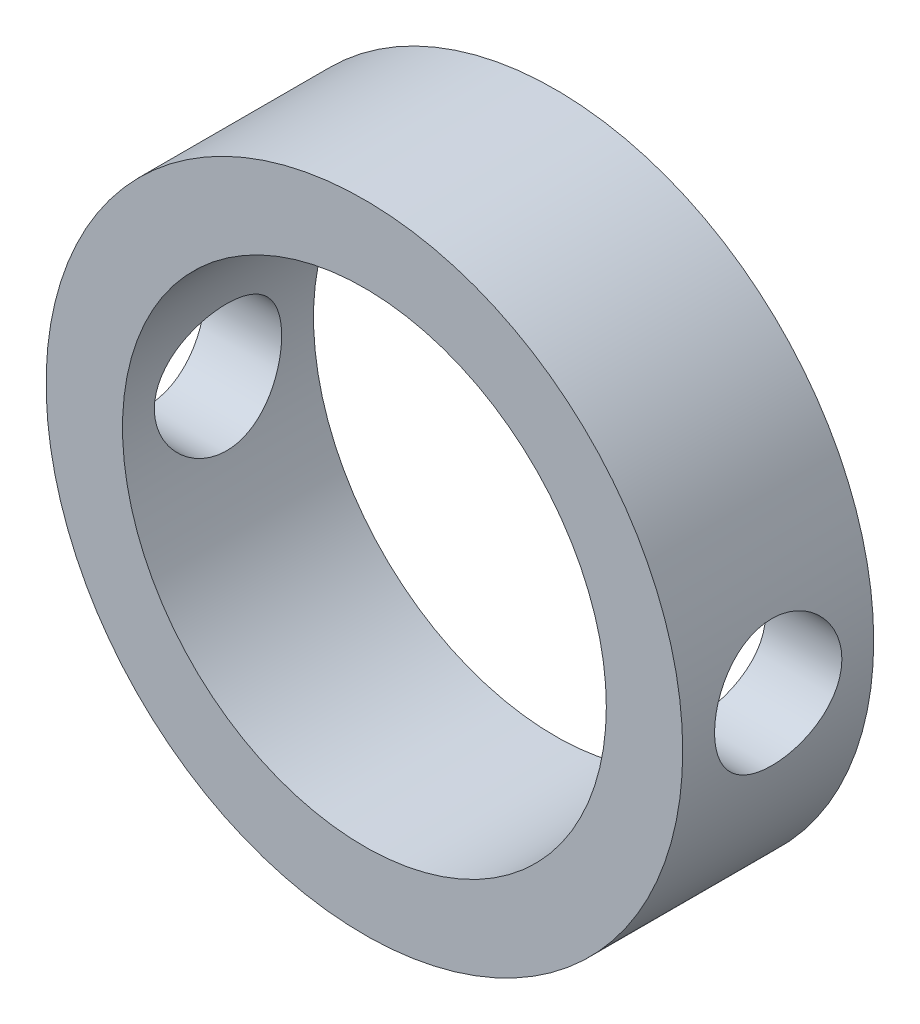
ISO-10303-21;
HEADER;
FILE_DESCRIPTION(('STEP AP214'),'2;1');
FILE_NAME('part.step','',(''),(''),'','','');
FILE_SCHEMA(('AUTOMOTIVE_DESIGN { 1 0 10303 214 1 1 1 1 }'));
ENDSEC;
DATA;
#1=APPLICATION_CONTEXT('core data for automotive mechanical design processes');
#2=APPLICATION_PROTOCOL_DEFINITION('international standard','automotive_design',2000,#1);
#3=PRODUCT_CONTEXT('',#1,'mechanical');
#4=PRODUCT('Part','Part','',(#3));
#5=PRODUCT_RELATED_PRODUCT_CATEGORY('part','',(#4));
#6=PRODUCT_DEFINITION_FORMATION('','',#4);
#7=PRODUCT_DEFINITION_CONTEXT('part definition',#1,'design');
#8=PRODUCT_DEFINITION('design','',#6,#7);
#9=PRODUCT_DEFINITION_SHAPE('','',#8);
#10=(LENGTH_UNIT() NAMED_UNIT(*) SI_UNIT(.MILLI.,.METRE.));
#11=(NAMED_UNIT(*) PLANE_ANGLE_UNIT() SI_UNIT($,.RADIAN.));
#12=(NAMED_UNIT(*) SI_UNIT($,.STERADIAN.) SOLID_ANGLE_UNIT());
#13=UNCERTAINTY_MEASURE_WITH_UNIT(LENGTH_MEASURE(1.E-05),#10,'distance_accuracy_value','');
#14=(GEOMETRIC_REPRESENTATION_CONTEXT(3) GLOBAL_UNCERTAINTY_ASSIGNED_CONTEXT((#13)) GLOBAL_UNIT_ASSIGNED_CONTEXT((#10,
#11,#12)) REPRESENTATION_CONTEXT('',''));
#15=CARTESIAN_POINT('',(0.,0.,0.));
#16=DIRECTION('',(0.,0.,1.));
#17=DIRECTION('',(1.,0.,0.));
#18=AXIS2_PLACEMENT_3D('',#15,#16,#17);
#19=CARTESIAN_POINT('',(0.,0.,6.));
#20=DIRECTION('',(0.,0.,1.));
#21=DIRECTION('',(1.,0.,0.));
#22=AXIS2_PLACEMENT_3D('',#19,#20,#21);
#23=PLANE('',#22);
#24=CARTESIAN_POINT('',(0.,0.,6.));
#25=DIRECTION('',(0.,0.,1.));
#26=DIRECTION('',(1.,0.,0.));
#27=AXIS2_PLACEMENT_3D('',#24,#25,#26);
#28=CIRCLE('',#27,10.);
#29=CARTESIAN_POINT('',(10.,0.,6.));
#30=VERTEX_POINT('',#29);
#31=EDGE_CURVE('E10',#30,#30,#28,.T.);
#32=ORIENTED_EDGE('',*,*,#31,.T.);
#33=EDGE_LOOP('',(#32));
#34=FACE_BOUND('',#33,.T.);
#35=CARTESIAN_POINT('',(0.,0.,6.));
#36=DIRECTION('',(0.,0.,1.));
#37=DIRECTION('',(1.,0.,0.));
#38=AXIS2_PLACEMENT_3D('',#35,#36,#37);
#39=CIRCLE('',#38,7.6);
#40=CARTESIAN_POINT('',(7.6,0.,6.));
#41=VERTEX_POINT('',#40);
#42=EDGE_CURVE('E52',#41,#41,#39,.T.);
#43=ORIENTED_EDGE('',*,*,#42,.F.);
#44=EDGE_LOOP('',(#43));
#45=FACE_BOUND('',#44,.T.);
#46=ADVANCED_FACE('F33',(#34,#45),#23,.T.);
#47=CARTESIAN_POINT('',(0.,0.,0.));
#48=DIRECTION('',(0.,0.,1.));
#49=DIRECTION('',(1.,0.,0.));
#50=AXIS2_PLACEMENT_3D('',#47,#48,#49);
#51=PLANE('',#50);
#52=CARTESIAN_POINT('',(0.,0.,0.));
#53=DIRECTION('',(0.,0.,1.));
#54=DIRECTION('',(1.,0.,0.));
#55=AXIS2_PLACEMENT_3D('',#52,#53,#54);
#56=CIRCLE('',#55,10.);
#57=CARTESIAN_POINT('',(10.,0.,0.));
#58=VERTEX_POINT('',#57);
#59=EDGE_CURVE('E47',#58,#58,#56,.T.);
#60=ORIENTED_EDGE('',*,*,#59,.F.);
#61=EDGE_LOOP('',(#60));
#62=FACE_BOUND('',#61,.T.);
#63=CARTESIAN_POINT('',(0.,0.,0.));
#64=DIRECTION('',(0.,0.,1.));
#65=DIRECTION('',(1.,0.,0.));
#66=AXIS2_PLACEMENT_3D('',#63,#64,#65);
#67=CIRCLE('',#66,7.6);
#68=CARTESIAN_POINT('',(7.6,0.,0.));
#69=VERTEX_POINT('',#68);
#70=EDGE_CURVE('E55',#69,#69,#67,.T.);
#71=ORIENTED_EDGE('',*,*,#70,.T.);
#72=EDGE_LOOP('',(#71));
#73=FACE_BOUND('',#72,.T.);
#74=ADVANCED_FACE('F91',(#62,#73),#51,.F.);
#75=CARTESIAN_POINT('',(0.,0.,6.));
#76=DIRECTION('',(0.,0.,-1.));
#77=DIRECTION('',(-1.,0.,0.));
#78=AXIS2_PLACEMENT_3D('',#75,#76,#77);
#79=CYLINDRICAL_SURFACE('',#78,10.);
#80=CARTESIAN_POINT('',(-10.,0.,1.));
#81=CARTESIAN_POINT('',(-9.99999795161742,0.111153813585266,1.00000408899669));
#82=CARTESIAN_POINT('',(-9.99812770356462,0.222359320403045,1.00929768593529));
#83=CARTESIAN_POINT('',(-9.99084731246463,0.441627015378039,1.04619700023049));
#84=CARTESIAN_POINT('',(-9.98543435720372,0.549686635082712,1.07381726560302));
#85=CARTESIAN_POINT('',(-9.97167298556573,0.759460610526626,1.14648254724158));
#86=CARTESIAN_POINT('',(-9.96332738153436,0.861180935866268,1.19151087368938));
#87=CARTESIAN_POINT('',(-9.94460796070629,1.05561597772845,1.29766449502259));
#88=CARTESIAN_POINT('',(-9.93423426471414,1.14833123015162,1.35878883121441));
#89=CARTESIAN_POINT('',(-9.9124433065994,1.32338695462973,1.49627698858287));
#90=CARTESIAN_POINT('',(-9.90101491008695,1.40558790231705,1.5728167107824));
#91=CARTESIAN_POINT('',(-9.87848360905177,1.55607351321606,1.7385848327834));
#92=CARTESIAN_POINT('',(-9.86738073000848,1.62435708954085,1.82781422267024));
#93=CARTESIAN_POINT('',(-9.8466488362523,1.74566350669524,2.01743238602375));
#94=CARTESIAN_POINT('',(-9.83703414729892,1.79854187773173,2.11791528759272));
#95=CARTESIAN_POINT('',(-9.82052536116836,1.88661133316062,2.32656363800816));
#96=CARTESIAN_POINT('',(-9.81363099523923,1.92180416487448,2.43472832669269));
#97=CARTESIAN_POINT('',(-9.80345610504409,1.97305059976965,2.65416872781583));
#98=CARTESIAN_POINT('',(-9.80012940214375,1.98934899591755,2.76538508828445));
#99=CARTESIAN_POINT('',(-9.79732750121254,2.00310425545224,2.98901964272868));
#100=CARTESIAN_POINT('',(-9.79785190935681,2.000563045427,3.10143771264029));
#101=CARTESIAN_POINT('',(-9.80265102296369,1.97690914620364,3.32249357604201));
#102=CARTESIAN_POINT('',(-9.80686905717527,1.95607708048781,3.43116281125463));
#103=CARTESIAN_POINT('',(-9.81849092320002,1.8968757692461,3.643432153326));
#104=CARTESIAN_POINT('',(-9.82589490715558,1.85850568620136,3.74703201783802));
#105=CARTESIAN_POINT('',(-9.84311237000816,1.76504956734944,3.9470305234072));
#106=CARTESIAN_POINT('',(-9.85294179627409,1.70985230246423,4.04337575913834));
#107=CARTESIAN_POINT('',(-9.87389237546124,1.58438714914536,4.22554169994563));
#108=CARTESIAN_POINT('',(-9.88501367676732,1.51411752871366,4.31136119370231));
#109=CARTESIAN_POINT('',(-9.90754042482924,1.35899986912117,4.47165880491387));
#110=CARTESIAN_POINT('',(-9.9189473842181,1.27391232242489,4.54590513571826));
#111=CARTESIAN_POINT('',(-9.94057697428817,1.09237004812402,4.67910769260245));
#112=CARTESIAN_POINT('',(-9.95079958977947,0.995915174758779,4.73806372258716));
#113=CARTESIAN_POINT('',(-9.96893380321774,0.794118773757842,4.83905501845195));
#114=CARTESIAN_POINT('',(-9.97684177696544,0.6887636391706,4.88106378728907));
#115=CARTESIAN_POINT('',(-9.98942817975716,0.47229795289733,4.94672094807713));
#116=CARTESIAN_POINT('',(-9.99410700001063,0.361188100144899,4.97037156414726));
#117=CARTESIAN_POINT('',(-9.99965343733736,0.138358811254301,4.99831290758855));
#118=CARTESIAN_POINT('',(-10.0005834930494,0.0266806566511525,5.00292083908054));
#119=CARTESIAN_POINT('',(-9.99870103860205,-0.195849868385428,4.99350028211564));
#120=CARTESIAN_POINT('',(-9.99588873882892,-0.306702284887586,4.97947284129481));
#121=CARTESIAN_POINT('',(-9.98687664016035,-0.523411319893082,4.93344325291209));
#122=CARTESIAN_POINT('',(-9.98070752808413,-0.629303896679806,4.90160386300419));
#123=CARTESIAN_POINT('',(-9.96567104122065,-0.834247254999334,4.82103203468838));
#124=CARTESIAN_POINT('',(-9.95680346428453,-0.933297523275079,4.77229833064634));
#125=CARTESIAN_POINT('',(-9.93719823066589,-1.12308234737244,4.65863501869737));
#126=CARTESIAN_POINT('',(-9.92643900874104,-1.21370025350438,4.59351443792211));
#127=CARTESIAN_POINT('',(-9.90429469659765,-1.38283603823841,4.44918161758544));
#128=CARTESIAN_POINT('',(-9.89290953936776,-1.46135261786153,4.36996786720027));
#129=CARTESIAN_POINT('',(-9.8705860711393,-1.60528118154835,4.19825329621775));
#130=CARTESIAN_POINT('',(-9.85965720466609,-1.67047540489731,4.10556851155733));
#131=CARTESIAN_POINT('',(-9.83968383592389,-1.78437084010241,3.91037727728664));
#132=CARTESIAN_POINT('',(-9.83063925826685,-1.83307271184581,3.8078712208529));
#133=CARTESIAN_POINT('',(-9.81553481168766,-1.91230368316392,3.5964635077009));
#134=CARTESIAN_POINT('',(-9.80945949744373,-1.9429269995821,3.48759831757936));
#135=CARTESIAN_POINT('',(-9.8009487358405,-1.98541730325439,3.26613309301819));
#136=CARTESIAN_POINT('',(-9.79851281382223,-1.99728673645023,3.15353354758131));
#137=CARTESIAN_POINT('',(-9.79758299262758,-2.00184182173494,2.92998227091136));
#138=CARTESIAN_POINT('',(-9.79901838378602,-1.99487157614179,2.81903770214598));
#139=CARTESIAN_POINT('',(-9.80551146969228,-1.96270460820012,2.59993670018995));
#140=CARTESIAN_POINT('',(-9.81056913534338,-1.9375080322586,2.49178024461039));
#141=CARTESIAN_POINT('',(-9.82370528438317,-1.86975713699791,2.28154457751891));
#142=CARTESIAN_POINT('',(-9.83177642037661,-1.82724501343469,2.17945127899517));
#143=CARTESIAN_POINT('',(-9.85003429948341,-1.72610928920321,1.98379255853112));
#144=CARTESIAN_POINT('',(-9.86022121997788,-1.66748433754977,1.89022785254973));
#145=CARTESIAN_POINT('',(-9.88177921046451,-1.53461182957283,1.71256885569937));
#146=CARTESIAN_POINT('',(-9.89316745819399,-1.46011577447036,1.62866246946481));
#147=CARTESIAN_POINT('',(-9.91572163743909,-1.29812873802628,1.47442758894166));
#148=CARTESIAN_POINT('',(-9.92688751726369,-1.21063477430667,1.40410221936546));
#149=CARTESIAN_POINT('',(-9.94787664775943,-1.02403525817649,1.27833071210711));
#150=CARTESIAN_POINT('',(-9.95768462438492,-0.92481776885967,1.22304799343995));
#151=CARTESIAN_POINT('',(-9.9747025017,-0.718332721881466,1.13002775480682));
#152=CARTESIAN_POINT('',(-9.98191474277232,-0.611072521726253,1.09227442093502));
#153=CARTESIAN_POINT('',(-9.99152745190741,-0.419642977847559,1.04269610391057));
#154=CARTESIAN_POINT('',(-9.99468606316904,-0.336563328027569,1.02671361258448));
#155=CARTESIAN_POINT('',(-9.99892308279786,-0.168999050420134,1.00536417528327));
#156=CARTESIAN_POINT('',(-10.0000015574631,-0.0845144674972381,0.999996890980464));
#157=CARTESIAN_POINT('',(-10.,0.,1.));
#158=B_SPLINE_CURVE_WITH_KNOTS('',3,(#80,#81,#82,#83,#84,#85,#86,#87,#88,#89,#90,#91,#92,#93,
#94,#95,#96,#97,#98,#99,#100,#101,#102,#103,#104,#105,#106,#107,#108,#109,#110,#111,#112,#113,
#114,#115,#116,#117,#118,#119,#120,#121,#122,#123,#124,#125,#126,#127,#128,#129,#130,#131,#132,
#133,#134,#135,#136,#137,#138,#139,#140,#141,#142,#143,#144,#145,#146,#147,#148,#149,#150,#151,
#152,#153,#154,#155,#156,#157),.UNSPECIFIED.,.T.,.F.,(4,2,2,2,2,2,2,2,2,2,2,2,2,2,2,2,2,2,2,2,2,
2,2,2,2,2,2,2,2,2,2,2,2,2,2,2,2,2,4),(0.,0.333152261322517,0.666569301382646,0.999667470500683,
1.33274580446173,1.66986534022437,2.00701119349473,2.34722390011845,2.68740298730395,
3.02312370207175,3.3588100856245,3.68943454012557,4.02007478507459,4.35294980407185,
4.68586309499341,5.02476504982701,5.36367135079641,5.70310549708048,6.04249851396072,
6.3762147135253,6.70991215315735,7.04060907901447,7.37133078432045,7.70610132066717,
8.0409077669186,8.38081257158452,8.72070377446933,9.05880762065446,9.3968673666083,
9.72879445135403,10.0607188698522,10.3918392250622,10.7229873516373,11.0597615247829,
11.3966130906586,11.7369899335127,12.0770591103504,12.3303755057979,12.5836838274199),.UNSPECIFIED.);
#159=CARTESIAN_POINT('',(-10.,0.,1.));
#160=VERTEX_POINT('',#159);
#161=EDGE_CURVE('E80',#160,#160,#158,.T.);
#162=ORIENTED_EDGE('',*,*,#161,.T.);
#163=EDGE_LOOP('',(#162));
#164=FACE_BOUND('',#163,.T.);
#165=CARTESIAN_POINT('',(10.,0.,1.));
#166=CARTESIAN_POINT('',(9.99999795161742,-0.111153813585266,1.00000408899669));
#167=CARTESIAN_POINT('',(9.99812770356462,-0.222359320403045,1.00929768593529));
#168=CARTESIAN_POINT('',(9.99084731246463,-0.441627015378039,1.04619700023049));
#169=CARTESIAN_POINT('',(9.98543435720372,-0.549686635082712,1.07381726560302));
#170=CARTESIAN_POINT('',(9.97167298556573,-0.759460610526626,1.14648254724158));
#171=CARTESIAN_POINT('',(9.96332738153436,-0.861180935866268,1.19151087368938));
#172=CARTESIAN_POINT('',(9.94460796070629,-1.05561597772845,1.29766449502259));
#173=CARTESIAN_POINT('',(9.93423426471414,-1.14833123015162,1.35878883121441));
#174=CARTESIAN_POINT('',(9.9124433065994,-1.32338695462973,1.49627698858287));
#175=CARTESIAN_POINT('',(9.90101491008695,-1.40558790231705,1.5728167107824));
#176=CARTESIAN_POINT('',(9.87848360905177,-1.55607351321606,1.7385848327834));
#177=CARTESIAN_POINT('',(9.86738073000848,-1.62435708954085,1.82781422267024));
#178=CARTESIAN_POINT('',(9.8466488362523,-1.74566350669524,2.01743238602375));
#179=CARTESIAN_POINT('',(9.83703414729892,-1.79854187773173,2.11791528759272));
#180=CARTESIAN_POINT('',(9.82052536116836,-1.88661133316062,2.32656363800816));
#181=CARTESIAN_POINT('',(9.81363099523923,-1.92180416487448,2.43472832669269));
#182=CARTESIAN_POINT('',(9.80345610504409,-1.97305059976965,2.65416872781583));
#183=CARTESIAN_POINT('',(9.80012940214375,-1.98934899591755,2.76538508828445));
#184=CARTESIAN_POINT('',(9.79732750121254,-2.00310425545224,2.98901964272868));
#185=CARTESIAN_POINT('',(9.79785190935681,-2.000563045427,3.10143771264029));
#186=CARTESIAN_POINT('',(9.80265102296369,-1.97690914620364,3.32249357604201));
#187=CARTESIAN_POINT('',(9.80686905717527,-1.95607708048781,3.43116281125463));
#188=CARTESIAN_POINT('',(9.81849092320002,-1.8968757692461,3.643432153326));
#189=CARTESIAN_POINT('',(9.82589490715558,-1.85850568620136,3.74703201783802));
#190=CARTESIAN_POINT('',(9.84311237000816,-1.76504956734944,3.9470305234072));
#191=CARTESIAN_POINT('',(9.85294179627409,-1.70985230246423,4.04337575913834));
#192=CARTESIAN_POINT('',(9.87389237546124,-1.58438714914536,4.22554169994563));
#193=CARTESIAN_POINT('',(9.88501367676732,-1.51411752871366,4.31136119370231));
#194=CARTESIAN_POINT('',(9.90754042482924,-1.35899986912117,4.47165880491387));
#195=CARTESIAN_POINT('',(9.9189473842181,-1.27391232242489,4.54590513571826));
#196=CARTESIAN_POINT('',(9.94057697428817,-1.09237004812402,4.67910769260245));
#197=CARTESIAN_POINT('',(9.95079958977947,-0.995915174758779,4.73806372258716));
#198=CARTESIAN_POINT('',(9.96893380321774,-0.794118773757842,4.83905501845195));
#199=CARTESIAN_POINT('',(9.97684177696544,-0.6887636391706,4.88106378728907));
#200=CARTESIAN_POINT('',(9.98942817975716,-0.47229795289733,4.94672094807713));
#201=CARTESIAN_POINT('',(9.99410700001063,-0.361188100144899,4.97037156414726));
#202=CARTESIAN_POINT('',(9.99965343733736,-0.138358811254301,4.99831290758855));
#203=CARTESIAN_POINT('',(10.0005834930494,-0.0266806566511525,5.00292083908054));
#204=CARTESIAN_POINT('',(9.99870103860205,0.195849868385428,4.99350028211564));
#205=CARTESIAN_POINT('',(9.99588873882892,0.306702284887586,4.97947284129481));
#206=CARTESIAN_POINT('',(9.98687664016035,0.523411319893082,4.93344325291209));
#207=CARTESIAN_POINT('',(9.98070752808413,0.629303896679806,4.90160386300419));
#208=CARTESIAN_POINT('',(9.96567104122065,0.834247254999334,4.82103203468838));
#209=CARTESIAN_POINT('',(9.95680346428453,0.933297523275079,4.77229833064634));
#210=CARTESIAN_POINT('',(9.93719823066589,1.12308234737244,4.65863501869737));
#211=CARTESIAN_POINT('',(9.92643900874104,1.21370025350438,4.59351443792211));
#212=CARTESIAN_POINT('',(9.90429469659765,1.38283603823841,4.44918161758544));
#213=CARTESIAN_POINT('',(9.89290953936776,1.46135261786153,4.36996786720027));
#214=CARTESIAN_POINT('',(9.8705860711393,1.60528118154835,4.19825329621775));
#215=CARTESIAN_POINT('',(9.85965720466609,1.67047540489731,4.10556851155733));
#216=CARTESIAN_POINT('',(9.83968383592389,1.78437084010241,3.91037727728664));
#217=CARTESIAN_POINT('',(9.83063925826685,1.83307271184581,3.8078712208529));
#218=CARTESIAN_POINT('',(9.81553481168766,1.91230368316392,3.5964635077009));
#219=CARTESIAN_POINT('',(9.80945949744373,1.9429269995821,3.48759831757936));
#220=CARTESIAN_POINT('',(9.8009487358405,1.98541730325439,3.26613309301819));
#221=CARTESIAN_POINT('',(9.79851281382223,1.99728673645023,3.15353354758131));
#222=CARTESIAN_POINT('',(9.79758299262758,2.00184182173494,2.92998227091136));
#223=CARTESIAN_POINT('',(9.79901838378602,1.99487157614179,2.81903770214598));
#224=CARTESIAN_POINT('',(9.80551146969228,1.96270460820012,2.59993670018995));
#225=CARTESIAN_POINT('',(9.81056913534338,1.9375080322586,2.49178024461039));
#226=CARTESIAN_POINT('',(9.82370528438317,1.86975713699791,2.28154457751891));
#227=CARTESIAN_POINT('',(9.83177642037661,1.82724501343469,2.17945127899517));
#228=CARTESIAN_POINT('',(9.85003429948341,1.72610928920321,1.98379255853112));
#229=CARTESIAN_POINT('',(9.86022121997788,1.66748433754977,1.89022785254973));
#230=CARTESIAN_POINT('',(9.88177921046451,1.53461182957283,1.71256885569937));
#231=CARTESIAN_POINT('',(9.89316745819399,1.46011577447036,1.62866246946481));
#232=CARTESIAN_POINT('',(9.91572163743909,1.29812873802628,1.47442758894166));
#233=CARTESIAN_POINT('',(9.92688751726369,1.21063477430667,1.40410221936546));
#234=CARTESIAN_POINT('',(9.94787664775943,1.02403525817649,1.27833071210711));
#235=CARTESIAN_POINT('',(9.95768462438492,0.92481776885967,1.22304799343995));
#236=CARTESIAN_POINT('',(9.9747025017,0.718332721881466,1.13002775480682));
#237=CARTESIAN_POINT('',(9.98191474277232,0.611072521726253,1.09227442093502));
#238=CARTESIAN_POINT('',(9.99152745190741,0.419642977847559,1.04269610391057));
#239=CARTESIAN_POINT('',(9.99468606316904,0.336563328027569,1.02671361258448));
#240=CARTESIAN_POINT('',(9.99892308279786,0.168999050420134,1.00536417528327));
#241=CARTESIAN_POINT('',(10.0000015574631,0.0845144674972381,0.999996890980464));
#242=CARTESIAN_POINT('',(10.,0.,1.));
#243=B_SPLINE_CURVE_WITH_KNOTS('',3,(#165,#166,#167,#168,#169,#170,#171,#172,#173,#174,#175,
#176,#177,#178,#179,#180,#181,#182,#183,#184,#185,#186,#187,#188,#189,#190,#191,#192,#193,#194,
#195,#196,#197,#198,#199,#200,#201,#202,#203,#204,#205,#206,#207,#208,#209,#210,#211,#212,#213,
#214,#215,#216,#217,#218,#219,#220,#221,#222,#223,#224,#225,#226,#227,#228,#229,#230,#231,#232,
#233,#234,#235,#236,#237,#238,#239,#240,#241,#242),.UNSPECIFIED.,.T.,.F.,(4,2,2,2,2,2,2,2,2,2,2,
2,2,2,2,2,2,2,2,2,2,2,2,2,2,2,2,2,2,2,2,2,2,2,2,2,2,2,4),(0.,0.333152261322517,
0.666569301382646,0.999667470500683,1.33274580446173,1.66986534022437,2.00701119349473,
2.34722390011845,2.68740298730395,3.02312370207175,3.3588100856245,3.68943454012557,
4.02007478507459,4.35294980407185,4.68586309499341,5.02476504982701,5.36367135079641,
5.70310549708048,6.04249851396072,6.3762147135253,6.70991215315735,7.04060907901447,
7.37133078432045,7.70610132066717,8.0409077669186,8.38081257158452,8.72070377446933,
9.05880762065446,9.3968673666083,9.72879445135403,10.0607188698522,10.3918392250622,
10.7229873516373,11.0597615247829,11.3966130906586,11.7369899335127,12.0770591103504,
12.3303755057979,12.5836838274199),.UNSPECIFIED.);
#244=CARTESIAN_POINT('',(10.,0.,1.));
#245=VERTEX_POINT('',#244);
#246=EDGE_CURVE('E75',#245,#245,#243,.T.);
#247=ORIENTED_EDGE('',*,*,#246,.T.);
#248=EDGE_LOOP('',(#247));
#249=FACE_BOUND('',#248,.T.);
#250=ORIENTED_EDGE('',*,*,#31,.F.);
#251=EDGE_LOOP('',(#250));
#252=FACE_BOUND('',#251,.T.);
#253=ORIENTED_EDGE('',*,*,#59,.T.);
#254=EDGE_LOOP('',(#253));
#255=FACE_BOUND('',#254,.T.);
#256=ADVANCED_FACE('F35',(#164,#249,#252,#255),#79,.T.);
#257=CARTESIAN_POINT('',(0.,0.,6.));
#258=DIRECTION('',(0.,0.,-1.));
#259=DIRECTION('',(-1.,0.,0.));
#260=AXIS2_PLACEMENT_3D('',#257,#258,#259);
#261=CYLINDRICAL_SURFACE('',#260,7.6);
#262=CARTESIAN_POINT('',(-7.6,0.,5.));
#263=CARTESIAN_POINT('',(-7.59999828714552,-0.110307730560133,4.99999727332697));
#264=CARTESIAN_POINT('',(-7.59757476442974,-0.220644935985643,4.99084353481075));
#265=CARTESIAN_POINT('',(-7.58814210091619,-0.438144337683257,4.95453308901949));
#266=CARTESIAN_POINT('',(-7.5811306691326,-0.545304919739092,4.92736738732782));
#267=CARTESIAN_POINT('',(-7.56329661060836,-0.753279836174661,4.85597473968142));
#268=CARTESIAN_POINT('',(-7.55247882716057,-0.854102044388118,4.81176946848747));
#269=CARTESIAN_POINT('',(-7.52817721226261,-1.04690122305247,4.70763198314898));
#270=CARTESIAN_POINT('',(-7.51469322173764,-1.13887766524863,4.64769883055689));
#271=CARTESIAN_POINT('',(-7.48617553309275,-1.3134559490354,4.51237470744187));
#272=CARTESIAN_POINT('',(-7.47111589382366,-1.39582907705723,4.43669413794759));
#273=CARTESIAN_POINT('',(-7.44131202366046,-1.54687267669245,4.27264275306714));
#274=CARTESIAN_POINT('',(-7.42656783246282,-1.61554143267683,4.18427035118859));
#275=CARTESIAN_POINT('',(-7.39879972888068,-1.73833366809745,3.99552898529889));
#276=CARTESIAN_POINT('',(-7.3858085903369,-1.79219559894539,3.89498459816491));
#277=CARTESIAN_POINT('',(-7.36339824512135,-1.8821611802115,3.68587031662129));
#278=CARTESIAN_POINT('',(-7.35397839897279,-1.91826801020807,3.57730186316783));
#279=CARTESIAN_POINT('',(-7.34004475767933,-1.97090716107826,3.35775045751483));
#280=CARTESIAN_POINT('',(-7.33542739495583,-1.98785342093871,3.24687348172334));
#281=CARTESIAN_POINT('',(-7.33131196120081,-2.00298065938738,3.02376159546161));
#282=CARTESIAN_POINT('',(-7.33181296060694,-2.0011650453797,2.91152693526287));
#283=CARTESIAN_POINT('',(-7.33778486187192,-1.979149052759,2.69210381644217));
#284=CARTESIAN_POINT('',(-7.34312080320096,-1.95944789524812,2.58486101301021));
#285=CARTESIAN_POINT('',(-7.35794548469441,-1.9030189360574,2.37525919705931));
#286=CARTESIAN_POINT('',(-7.36743454901552,-1.86628980530865,2.2729005664482));
#287=CARTESIAN_POINT('',(-7.38961608705182,-1.77643671868735,2.07466337033174));
#288=CARTESIAN_POINT('',(-7.40234273435973,-1.72313642535824,1.97886871674745));
#289=CARTESIAN_POINT('',(-7.42954689825237,-1.60177709616017,1.79740691268406));
#290=CARTESIAN_POINT('',(-7.44402475108877,-1.53371522390164,1.71174171344167));
#291=CARTESIAN_POINT('',(-7.47366321085344,-1.38220501716882,1.55011640603572));
#292=CARTESIAN_POINT('',(-7.48883090576095,-1.29833701281234,1.47455046241615));
#293=CARTESIAN_POINT('',(-7.51772761269716,-1.11893447236056,1.33847627648179));
#294=CARTESIAN_POINT('',(-7.53145657091021,-1.02339950015396,1.27796859730194));
#295=CARTESIAN_POINT('',(-7.55600975901614,-0.82277487026988,1.17356125603069));
#296=CARTESIAN_POINT('',(-7.56682173537758,-0.717647314974279,1.12973134653084));
#297=CARTESIAN_POINT('',(-7.58423407316033,-0.50116682028137,1.06047966896322));
#298=CARTESIAN_POINT('',(-7.59083533002147,-0.389815209955924,1.03505398694887));
#299=CARTESIAN_POINT('',(-7.59894765438889,-0.167412666022036,1.0039477434924));
#300=CARTESIAN_POINT('',(-7.60059688444822,-0.0564416383871433,0.997731098397748));
#301=CARTESIAN_POINT('',(-7.5990157568394,0.16495686985393,1.00374111690053));
#302=CARTESIAN_POINT('',(-7.59578588936938,0.27538440394612,1.01596592770282));
#303=CARTESIAN_POINT('',(-7.58489857100534,0.490658812331468,1.05807163649291));
#304=CARTESIAN_POINT('',(-7.57731579392175,0.595568016421661,1.08765493602793));
#305=CARTESIAN_POINT('',(-7.55858152533492,0.798925563600332,1.16329349643487));
#306=CARTESIAN_POINT('',(-7.54742965240509,0.897373214791766,1.20935051790303));
#307=CARTESIAN_POINT('',(-7.5224689005433,1.087106884953,1.31763305770661));
#308=CARTESIAN_POINT('',(-7.50861311209609,1.17821907925447,1.38015207165798));
#309=CARTESIAN_POINT('',(-7.47984688525879,1.34884778064121,1.51921362431206));
#310=CARTESIAN_POINT('',(-7.46493624454205,1.4283620541759,1.59575885782469));
#311=CARTESIAN_POINT('',(-7.4352348380538,1.57578615105465,1.76319920856277));
#312=CARTESIAN_POINT('',(-7.42045855902877,1.6433181824352,1.85443013067817));
#313=CARTESIAN_POINT('',(-7.39314959630072,1.7621206182736,2.04724039689845));
#314=CARTESIAN_POINT('',(-7.38061681721743,1.81339171412129,2.14881930078045));
#315=CARTESIAN_POINT('',(-7.35935694580314,1.8978309121971,2.35892498766296));
#316=CARTESIAN_POINT('',(-7.35060770280331,1.93110467542322,2.46740694497724));
#317=CARTESIAN_POINT('',(-7.33789680527255,1.97886148433562,2.68869458185313));
#318=CARTESIAN_POINT('',(-7.33393396608941,1.99334917970686,2.80149918441032));
#319=CARTESIAN_POINT('',(-7.33134168191522,2.00286032469265,3.0243673421597));
#320=CARTESIAN_POINT('',(-7.33254605516003,1.99849022962561,3.13440347625629));
#321=CARTESIAN_POINT('',(-7.33976445825453,1.97181256046432,3.35211040335236));
#322=CARTESIAN_POINT('',(-7.34577837041293,1.94950542529638,3.45978125416501));
#323=CARTESIAN_POINT('',(-7.3618406508767,1.88793420922453,3.66896036119323));
#324=CARTESIAN_POINT('',(-7.37185916244945,1.84879545796601,3.7705079608682));
#325=CARTESIAN_POINT('',(-7.39480324107711,1.75476964730114,3.9656713309879));
#326=CARTESIAN_POINT('',(-7.40772925305212,1.69988017728703,4.05928588445698));
#327=CARTESIAN_POINT('',(-7.43549553134529,1.57405944722419,4.23882833006595));
#328=CARTESIAN_POINT('',(-7.45038010513534,1.5027128303594,4.32445833405862));
#329=CARTESIAN_POINT('',(-7.48013537399376,1.34679721909923,4.48272753068859));
#330=CARTESIAN_POINT('',(-7.49500606483625,1.26222503185927,4.55536357729419));
#331=CARTESIAN_POINT('',(-7.52342540654559,1.08014966904107,4.68705619708457));
#332=CARTESIAN_POINT('',(-7.53694038190439,0.982415365446773,4.74580108779218));
#333=CARTESIAN_POINT('',(-7.56076012805248,0.778107103332891,4.84593396047491));
#334=CARTESIAN_POINT('',(-7.57106701000187,0.671539016816947,4.88733336328497));
#335=CARTESIAN_POINT('',(-7.5859349673448,0.471100637221475,4.9460384721217));
#336=CARTESIAN_POINT('',(-7.59117140003552,0.378114681591973,4.96622776042777));
#337=CARTESIAN_POINT('',(-7.59820449391819,0.19009298535238,4.993209074221));
#338=CARTESIAN_POINT('',(-7.60000147604846,0.0950574368286502,5.0000023497043));
#339=CARTESIAN_POINT('',(-7.6,0.,5.));
#340=B_SPLINE_CURVE_WITH_KNOTS('',3,(#262,#263,#264,#265,#266,#267,#268,#269,#270,#271,#272,
#273,#274,#275,#276,#277,#278,#279,#280,#281,#282,#283,#284,#285,#286,#287,#288,#289,#290,#291,
#292,#293,#294,#295,#296,#297,#298,#299,#300,#301,#302,#303,#304,#305,#306,#307,#308,#309,#310,
#311,#312,#313,#314,#315,#316,#317,#318,#319,#320,#321,#322,#323,#324,#325,#326,#327,#328,#329,
#330,#331,#332,#333,#334,#335,#336,#337,#338,#339),.UNSPECIFIED.,.T.,.F.,(4,2,2,2,2,2,2,2,2,2,2,
2,2,2,2,2,2,2,2,2,2,2,2,2,2,2,2,2,2,2,2,2,2,2,2,2,2,2,4),(0.,0.330574645834023,
0.661314491187416,0.991635008125812,1.32197523903445,1.65903413949998,1.99613520941282,
2.33885568494099,2.68151476381289,3.01662056728243,3.3516655121819,3.67763689182931,
4.00363371850887,4.33322568429279,4.66288103630069,5.00299580592632,5.34312329293655,
5.68465807920426,6.02612021140573,6.35796260710344,6.68977166513867,7.01605177441632,
7.34236676465521,7.67494788505055,8.00759297025067,8.34935532098778,8.69110313856947,
9.0308221805077,9.37045712351517,9.69925242300548,10.0280396769924,10.3544200269369,
10.6808503552366,11.0166535224827,11.3525378829913,11.6953641850873,12.0379644030747,
12.3228629404097,12.6077348923025),.UNSPECIFIED.);
#341=CARTESIAN_POINT('',(-7.6,0.,5.));
#342=VERTEX_POINT('',#341);
#343=EDGE_CURVE('E38',#342,#342,#340,.T.);
#344=ORIENTED_EDGE('',*,*,#343,.F.);
#345=EDGE_LOOP('',(#344));
#346=FACE_BOUND('',#345,.T.);
#347=CARTESIAN_POINT('',(7.6,0.,1.));
#348=CARTESIAN_POINT('',(7.59999828714552,-0.110307730560133,1.00000272667303));
#349=CARTESIAN_POINT('',(7.59757476442974,-0.220644935985643,1.00915646518925));
#350=CARTESIAN_POINT('',(7.58814210091619,-0.438144337683257,1.04546691098051));
#351=CARTESIAN_POINT('',(7.5811306691326,-0.545304919739092,1.07263261267218));
#352=CARTESIAN_POINT('',(7.56329661060836,-0.75327983617466,1.14402526031858));
#353=CARTESIAN_POINT('',(7.55247882716057,-0.854102044388117,1.18823053151253));
#354=CARTESIAN_POINT('',(7.52817721226261,-1.04690122305247,1.29236801685102));
#355=CARTESIAN_POINT('',(7.51469322173764,-1.13887766524863,1.35230116944311));
#356=CARTESIAN_POINT('',(7.48617553309275,-1.3134559490354,1.48762529255813));
#357=CARTESIAN_POINT('',(7.47111589382366,-1.39582907705722,1.56330586205241));
#358=CARTESIAN_POINT('',(7.44131202366046,-1.54687267669245,1.72735724693286));
#359=CARTESIAN_POINT('',(7.42656783246282,-1.61554143267683,1.81572964881141));
#360=CARTESIAN_POINT('',(7.39879972888068,-1.73833366809745,2.00447101470111));
#361=CARTESIAN_POINT('',(7.3858085903369,-1.79219559894539,2.10501540183509));
#362=CARTESIAN_POINT('',(7.36339824512135,-1.8821611802115,2.31412968337871));
#363=CARTESIAN_POINT('',(7.35397839897279,-1.91826801020807,2.42269813683217));
#364=CARTESIAN_POINT('',(7.34004475767933,-1.97090716107826,2.64224954248517));
#365=CARTESIAN_POINT('',(7.33542739495583,-1.98785342093871,2.75312651827666));
#366=CARTESIAN_POINT('',(7.33131196120081,-2.00298065938738,2.97623840453839));
#367=CARTESIAN_POINT('',(7.33181296060694,-2.0011650453797,3.08847306473713));
#368=CARTESIAN_POINT('',(7.33778486187192,-1.979149052759,3.30789618355783));
#369=CARTESIAN_POINT('',(7.34312080320096,-1.95944789524812,3.41513898698979));
#370=CARTESIAN_POINT('',(7.35794548469441,-1.9030189360574,3.62474080294069));
#371=CARTESIAN_POINT('',(7.36743454901552,-1.86628980530865,3.7270994335518));
#372=CARTESIAN_POINT('',(7.38961608705182,-1.77643671868735,3.92533662966826));
#373=CARTESIAN_POINT('',(7.40234273435973,-1.72313642535824,4.02113128325255));
#374=CARTESIAN_POINT('',(7.42954689825237,-1.60177709616017,4.20259308731594));
#375=CARTESIAN_POINT('',(7.44402475108877,-1.53371522390164,4.28825828655833));
#376=CARTESIAN_POINT('',(7.47366321085344,-1.38220501716882,4.44988359396427));
#377=CARTESIAN_POINT('',(7.48883090576095,-1.29833701281234,4.52544953758385));
#378=CARTESIAN_POINT('',(7.51772761269716,-1.11893447236056,4.66152372351821));
#379=CARTESIAN_POINT('',(7.53145657091021,-1.02339950015396,4.72203140269806));
#380=CARTESIAN_POINT('',(7.55600975901614,-0.82277487026988,4.82643874396931));
#381=CARTESIAN_POINT('',(7.56682173537758,-0.717647314974279,4.87026865346916));
#382=CARTESIAN_POINT('',(7.58423407316033,-0.50116682028137,4.93952033103678));
#383=CARTESIAN_POINT('',(7.59083533002147,-0.389815209955925,4.96494601305113));
#384=CARTESIAN_POINT('',(7.59894765438889,-0.167412666022036,4.9960522565076));
#385=CARTESIAN_POINT('',(7.60059688444822,-0.0564416383871434,5.00226890160225));
#386=CARTESIAN_POINT('',(7.5990157568394,0.16495686985393,4.99625888309947));
#387=CARTESIAN_POINT('',(7.59578588936938,0.27538440394612,4.98403407229718));
#388=CARTESIAN_POINT('',(7.58489857100534,0.490658812331468,4.94192836350709));
#389=CARTESIAN_POINT('',(7.57731579392175,0.595568016421661,4.91234506397207));
#390=CARTESIAN_POINT('',(7.55858152533492,0.798925563600332,4.83670650356513));
#391=CARTESIAN_POINT('',(7.54742965240509,0.897373214791765,4.79064948209697));
#392=CARTESIAN_POINT('',(7.5224689005433,1.087106884953,4.68236694229339));
#393=CARTESIAN_POINT('',(7.50861311209609,1.17821907925447,4.61984792834202));
#394=CARTESIAN_POINT('',(7.47984688525879,1.34884778064121,4.48078637568794));
#395=CARTESIAN_POINT('',(7.46493624454205,1.4283620541759,4.40424114217531));
#396=CARTESIAN_POINT('',(7.4352348380538,1.57578615105465,4.23680079143723));
#397=CARTESIAN_POINT('',(7.42045855902877,1.6433181824352,4.14556986932183));
#398=CARTESIAN_POINT('',(7.39314959630072,1.7621206182736,3.95275960310155));
#399=CARTESIAN_POINT('',(7.38061681721743,1.81339171412129,3.85118069921955));
#400=CARTESIAN_POINT('',(7.35935694580314,1.8978309121971,3.64107501233704));
#401=CARTESIAN_POINT('',(7.35060770280331,1.93110467542322,3.53259305502276));
#402=CARTESIAN_POINT('',(7.33789680527255,1.97886148433562,3.31130541814687));
#403=CARTESIAN_POINT('',(7.33393396608941,1.99334917970686,3.19850081558968));
#404=CARTESIAN_POINT('',(7.33134168191522,2.00286032469265,2.9756326578403));
#405=CARTESIAN_POINT('',(7.33254605516003,1.99849022962561,2.86559652374371));
#406=CARTESIAN_POINT('',(7.33976445825453,1.97181256046432,2.64788959664764));
#407=CARTESIAN_POINT('',(7.34577837041293,1.94950542529638,2.54021874583499));
#408=CARTESIAN_POINT('',(7.3618406508767,1.88793420922453,2.33103963880677));
#409=CARTESIAN_POINT('',(7.37185916244945,1.84879545796601,2.2294920391318));
#410=CARTESIAN_POINT('',(7.39480324107711,1.75476964730114,2.0343286690121));
#411=CARTESIAN_POINT('',(7.40772925305212,1.69988017728703,1.94071411554302));
#412=CARTESIAN_POINT('',(7.43549553134529,1.57405944722419,1.76117166993405));
#413=CARTESIAN_POINT('',(7.45038010513534,1.5027128303594,1.67554166594138));
#414=CARTESIAN_POINT('',(7.48013537399376,1.34679721909923,1.51727246931141));
#415=CARTESIAN_POINT('',(7.49500606483625,1.26222503185927,1.44463642270581));
#416=CARTESIAN_POINT('',(7.52342540654559,1.08014966904107,1.31294380291543));
#417=CARTESIAN_POINT('',(7.53694038190439,0.982415365446774,1.25419891220782));
#418=CARTESIAN_POINT('',(7.56076012805248,0.778107103332892,1.15406603952509));
#419=CARTESIAN_POINT('',(7.57106701000187,0.671539016816948,1.11266663671503));
#420=CARTESIAN_POINT('',(7.5859349673448,0.471100637221476,1.0539615278783));
#421=CARTESIAN_POINT('',(7.59117140003552,0.378114681591973,1.03377223957223));
#422=CARTESIAN_POINT('',(7.59820449391819,0.19009298535238,1.006790925779));
#423=CARTESIAN_POINT('',(7.60000147604846,0.0950574368286502,0.999997650295699));
#424=CARTESIAN_POINT('',(7.6,0.,1.));
#425=B_SPLINE_CURVE_WITH_KNOTS('',3,(#347,#348,#349,#350,#351,#352,#353,#354,#355,#356,#357,
#358,#359,#360,#361,#362,#363,#364,#365,#366,#367,#368,#369,#370,#371,#372,#373,#374,#375,#376,
#377,#378,#379,#380,#381,#382,#383,#384,#385,#386,#387,#388,#389,#390,#391,#392,#393,#394,#395,
#396,#397,#398,#399,#400,#401,#402,#403,#404,#405,#406,#407,#408,#409,#410,#411,#412,#413,#414,
#415,#416,#417,#418,#419,#420,#421,#422,#423,#424),.UNSPECIFIED.,.T.,.F.,(4,2,2,2,2,2,2,2,2,2,2,
2,2,2,2,2,2,2,2,2,2,2,2,2,2,2,2,2,2,2,2,2,2,2,2,2,2,2,4),(0.,0.330574645834023,
0.661314491187415,0.991635008125811,1.32197523903445,1.65903413949998,1.99613520941281,
2.33885568494099,2.68151476381289,3.01662056728243,3.3516655121819,3.67763689182931,
4.00363371850887,4.33322568429279,4.66288103630069,5.00299580592632,5.34312329293655,
5.68465807920426,6.02612021140573,6.35796260710344,6.68977166513867,7.01605177441632,
7.34236676465521,7.67494788505055,8.00759297025066,8.34935532098778,8.69110313856947,
9.0308221805077,9.37045712351517,9.69925242300548,10.0280396769924,10.3544200269369,
10.6808503552366,11.0166535224827,11.3525378829913,11.6953641850873,12.0379644030747,
12.3228629404097,12.6077348923025),.UNSPECIFIED.);
#426=CARTESIAN_POINT('',(7.6,0.,1.));
#427=VERTEX_POINT('',#426);
#428=EDGE_CURVE('E57',#427,#427,#425,.T.);
#429=ORIENTED_EDGE('',*,*,#428,.F.);
#430=EDGE_LOOP('',(#429));
#431=FACE_BOUND('',#430,.T.);
#432=ORIENTED_EDGE('',*,*,#42,.T.);
#433=EDGE_LOOP('',(#432));
#434=FACE_BOUND('',#433,.T.);
#435=ORIENTED_EDGE('',*,*,#70,.F.);
#436=EDGE_LOOP('',(#435));
#437=FACE_BOUND('',#436,.T.);
#438=ADVANCED_FACE('F62',(#346,#431,#434,#437),#261,.F.);
#439=CARTESIAN_POINT('',(-10.,0.,3.));
#440=DIRECTION('',(1.,0.,0.));
#441=DIRECTION('',(0.,0.,-1.));
#442=AXIS2_PLACEMENT_3D('',#439,#440,#441);
#443=CYLINDRICAL_SURFACE('',#442,2.);
#444=ORIENTED_EDGE('',*,*,#428,.T.);
#445=EDGE_LOOP('',(#444));
#446=FACE_BOUND('',#445,.T.);
#447=ORIENTED_EDGE('',*,*,#246,.F.);
#448=EDGE_LOOP('',(#447));
#449=FACE_BOUND('',#448,.T.);
#450=ADVANCED_FACE('F68',(#446,#449),#443,.F.);
#451=ORIENTED_EDGE('',*,*,#343,.T.);
#452=EDGE_LOOP('',(#451));
#453=FACE_BOUND('',#452,.T.);
#454=ORIENTED_EDGE('',*,*,#161,.F.);
#455=EDGE_LOOP('',(#454));
#456=FACE_BOUND('',#455,.T.);
#457=ADVANCED_FACE('F65',(#453,#456),#443,.F.);
#458=CLOSED_SHELL('',(#46,#74,#256,#438,#450,#457));
#459=MANIFOLD_SOLID_BREP('B2',#458);
#460=ADVANCED_BREP_SHAPE_REPRESENTATION('',(#18,#459),#14);
#461=SHAPE_DEFINITION_REPRESENTATION(#9,#460);
ENDSEC;
END-ISO-10303-21;
